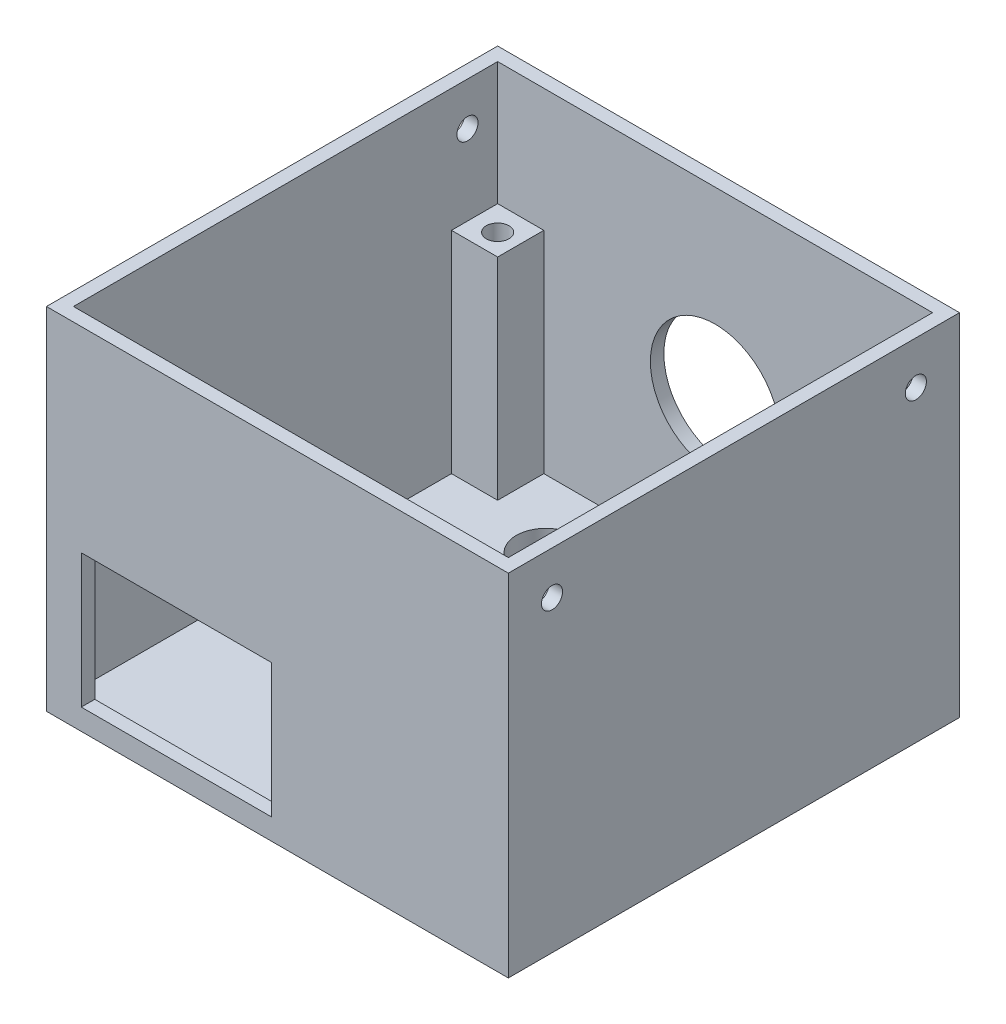
ISO-10303-21;
HEADER;
FILE_DESCRIPTION(('STEP AP214'),'2;1');
FILE_NAME('part.step','',(''),(''),'','','');
FILE_SCHEMA(('AUTOMOTIVE_DESIGN { 1 0 10303 214 1 1 1 1 }'));
ENDSEC;
DATA;
#1=APPLICATION_CONTEXT('core data for automotive mechanical design processes');
#2=APPLICATION_PROTOCOL_DEFINITION('international standard','automotive_design',2000,#1);
#3=PRODUCT_CONTEXT('',#1,'mechanical');
#4=PRODUCT('Part','Part','',(#3));
#5=PRODUCT_RELATED_PRODUCT_CATEGORY('part','',(#4));
#6=PRODUCT_DEFINITION_FORMATION('','',#4);
#7=PRODUCT_DEFINITION_CONTEXT('part definition',#1,'design');
#8=PRODUCT_DEFINITION('design','',#6,#7);
#9=PRODUCT_DEFINITION_SHAPE('','',#8);
#10=(LENGTH_UNIT() NAMED_UNIT(*) SI_UNIT(.MILLI.,.METRE.));
#11=(NAMED_UNIT(*) PLANE_ANGLE_UNIT() SI_UNIT($,.RADIAN.));
#12=(NAMED_UNIT(*) SI_UNIT($,.STERADIAN.) SOLID_ANGLE_UNIT());
#13=UNCERTAINTY_MEASURE_WITH_UNIT(LENGTH_MEASURE(1.E-05),#10,'distance_accuracy_value','');
#14=(GEOMETRIC_REPRESENTATION_CONTEXT(3) GLOBAL_UNCERTAINTY_ASSIGNED_CONTEXT((#13)) GLOBAL_UNIT_ASSIGNED_CONTEXT((#10,
#11,#12)) REPRESENTATION_CONTEXT('',''));
#15=CARTESIAN_POINT('',(0.,0.,0.));
#16=DIRECTION('',(0.,0.,1.));
#17=DIRECTION('',(1.,0.,0.));
#18=AXIS2_PLACEMENT_3D('',#15,#16,#17);
#19=CARTESIAN_POINT('',(0.,1.99999999999999,0.));
#20=DIRECTION('',(0.,1.,0.));
#21=DIRECTION('',(0.,0.,1.));
#22=AXIS2_PLACEMENT_3D('',#19,#20,#21);
#23=PLANE('',#22);
#24=CARTESIAN_POINT('',(12.6537793137482,1.99999999999999,10.0357560074556));
#25=DIRECTION('',(0.,1.,0.));
#26=DIRECTION('',(0.,0.,1.));
#27=AXIS2_PLACEMENT_3D('',#24,#25,#26);
#28=CIRCLE('',#27,3.6);
#29=CARTESIAN_POINT('',(12.6537793137482,1.99999999999999,13.6357560074556));
#30=VERTEX_POINT('',#29);
#31=EDGE_CURVE('E219',#30,#30,#28,.F.);
#32=ORIENTED_EDGE('',*,*,#31,.T.);
#33=EDGE_LOOP('',(#32));
#34=FACE_BOUND('',#33,.T.);
#35=CARTESIAN_POINT('',(8.72674435430912,1.99999999999999,-1.52718026200394));
#36=DIRECTION('',(0.,1.,0.));
#37=DIRECTION('',(0.,0.,1.));
#38=AXIS2_PLACEMENT_3D('',#35,#36,#37);
#39=CIRCLE('',#38,3.1);
#40=CARTESIAN_POINT('',(8.72674435430912,1.99999999999999,1.57281973799606));
#41=VERTEX_POINT('',#40);
#42=EDGE_CURVE('E225',#41,#41,#39,.F.);
#43=ORIENTED_EDGE('',*,*,#42,.T.);
#44=EDGE_LOOP('',(#43));
#45=FACE_BOUND('',#44,.T.);
#46=CARTESIAN_POINT('',(16.9080671864739,1.99999999999999,-1.52718026200394));
#47=DIRECTION('',(0.,1.,0.));
#48=DIRECTION('',(0.,0.,1.));
#49=AXIS2_PLACEMENT_3D('',#46,#47,#48);
#50=CIRCLE('',#49,3.1);
#51=CARTESIAN_POINT('',(16.9080671864739,1.99999999999999,1.57281973799606));
#52=VERTEX_POINT('',#51);
#53=EDGE_CURVE('E231',#52,#52,#50,.F.);
#54=ORIENTED_EDGE('',*,*,#53,.T.);
#55=EDGE_LOOP('',(#54));
#56=FACE_BOUND('',#55,.T.);
#57=CARTESIAN_POINT('',(-12.1083577916039,1.99999999999999,-17.1868597737186));
#58=DIRECTION('',(0.,1.,0.));
#59=DIRECTION('',(0.,0.,1.));
#60=AXIS2_PLACEMENT_3D('',#57,#58,#59);
#61=CIRCLE('',#60,3.5);
#62=CARTESIAN_POINT('',(-12.1083577916039,1.99999999999999,-13.6868597737186));
#63=VERTEX_POINT('',#62);
#64=EDGE_CURVE('E237',#63,#63,#61,.F.);
#65=ORIENTED_EDGE('',*,*,#64,.T.);
#66=EDGE_LOOP('',(#65));
#67=FACE_BOUND('',#66,.T.);
#68=CARTESIAN_POINT('',(12.7628636181771,1.99999999999999,-17.1868597737186));
#69=DIRECTION('',(0.,1.,0.));
#70=DIRECTION('',(0.,0.,1.));
#71=AXIS2_PLACEMENT_3D('',#68,#69,#70);
#72=CIRCLE('',#71,3.5);
#73=CARTESIAN_POINT('',(12.7628636181771,1.99999999999999,-13.6868597737186));
#74=VERTEX_POINT('',#73);
#75=EDGE_CURVE('E243',#74,#74,#72,.F.);
#76=ORIENTED_EDGE('',*,*,#75,.T.);
#77=EDGE_LOOP('',(#76));
#78=FACE_BOUND('',#77,.T.);
#79=DIRECTION('',(0.,0.,1.));
#80=VECTOR('',#79,1.);
#81=CARTESIAN_POINT('',(20.32,1.99999999999999,25.165));
#82=LINE('',#81,#80);
#83=CARTESIAN_POINT('',(20.32,1.99999999999999,19.685));
#84=VERTEX_POINT('',#83);
#85=CARTESIAN_POINT('',(20.32,1.99999999999999,25.165));
#86=VERTEX_POINT('',#85);
#87=EDGE_CURVE('E274',#84,#86,#82,.T.);
#88=ORIENTED_EDGE('',*,*,#87,.F.);
#89=DIRECTION('',(-1.,0.,0.));
#90=VECTOR('',#89,1.);
#91=CARTESIAN_POINT('',(25.8,1.99999999999999,19.685));
#92=LINE('',#91,#90);
#93=CARTESIAN_POINT('',(25.8,1.99999999999999,19.685));
#94=VERTEX_POINT('',#93);
#95=EDGE_CURVE('E267',#94,#84,#92,.T.);
#96=ORIENTED_EDGE('',*,*,#95,.F.);
#97=DIRECTION('',(0.,0.,-1.));
#98=VECTOR('',#97,1.);
#99=CARTESIAN_POINT('',(25.8,1.99999999999999,25.165));
#100=LINE('',#99,#98);
#101=CARTESIAN_POINT('',(25.8,1.99999999999999,-19.685));
#102=VERTEX_POINT('',#101);
#103=EDGE_CURVE('E346',#94,#102,#100,.T.);
#104=ORIENTED_EDGE('',*,*,#103,.T.);
#105=DIRECTION('',(1.,0.,0.));
#106=VECTOR('',#105,1.);
#107=CARTESIAN_POINT('',(25.8,1.99999999999999,-19.685));
#108=LINE('',#107,#106);
#109=CARTESIAN_POINT('',(20.32,1.99999999999999,-19.685));
#110=VERTEX_POINT('',#109);
#111=EDGE_CURVE('E296',#110,#102,#108,.T.);
#112=ORIENTED_EDGE('',*,*,#111,.F.);
#113=DIRECTION('',(0.,0.,1.));
#114=VECTOR('',#113,1.);
#115=CARTESIAN_POINT('',(20.32,1.99999999999999,-25.165));
#116=LINE('',#115,#114);
#117=CARTESIAN_POINT('',(20.32,1.99999999999999,-25.165));
#118=VERTEX_POINT('',#117);
#119=EDGE_CURVE('E291',#118,#110,#116,.T.);
#120=ORIENTED_EDGE('',*,*,#119,.F.);
#121=DIRECTION('',(-1.,0.,0.));
#122=VECTOR('',#121,1.);
#123=CARTESIAN_POINT('',(25.8,1.99999999999999,-25.165));
#124=LINE('',#123,#122);
#125=CARTESIAN_POINT('',(-20.32,1.99999999999999,-25.165));
#126=VERTEX_POINT('',#125);
#127=EDGE_CURVE('E348',#118,#126,#124,.T.);
#128=ORIENTED_EDGE('',*,*,#127,.T.);
#129=DIRECTION('',(0.,0.,-1.));
#130=VECTOR('',#129,1.);
#131=CARTESIAN_POINT('',(-20.32,1.99999999999999,-25.165));
#132=LINE('',#131,#130);
#133=CARTESIAN_POINT('',(-20.32,1.99999999999999,-19.685));
#134=VERTEX_POINT('',#133);
#135=EDGE_CURVE('E322',#134,#126,#132,.T.);
#136=ORIENTED_EDGE('',*,*,#135,.F.);
#137=DIRECTION('',(1.,0.,0.));
#138=VECTOR('',#137,1.);
#139=CARTESIAN_POINT('',(-25.8,1.99999999999999,-19.685));
#140=LINE('',#139,#138);
#141=CARTESIAN_POINT('',(-25.8,1.99999999999999,-19.685));
#142=VERTEX_POINT('',#141);
#143=EDGE_CURVE('E317',#142,#134,#140,.T.);
#144=ORIENTED_EDGE('',*,*,#143,.F.);
#145=DIRECTION('',(0.,0.,1.));
#146=VECTOR('',#145,1.);
#147=CARTESIAN_POINT('',(-25.8,1.99999999999999,25.165));
#148=LINE('',#147,#146);
#149=CARTESIAN_POINT('',(-25.8,1.99999999999999,25.165));
#150=VERTEX_POINT('',#149);
#151=EDGE_CURVE('E340',#142,#150,#148,.T.);
#152=ORIENTED_EDGE('',*,*,#151,.T.);
#153=DIRECTION('',(1.,0.,0.));
#154=VECTOR('',#153,1.);
#155=CARTESIAN_POINT('',(25.8,1.99999999999999,25.165));
#156=LINE('',#155,#154);
#157=EDGE_CURVE('E342',#150,#86,#156,.T.);
#158=ORIENTED_EDGE('',*,*,#157,.T.);
#159=EDGE_LOOP('',(#88,#96,#104,#112,#120,#128,#136,#144,#152,#158));
#160=FACE_BOUND('',#159,.T.);
#161=ADVANCED_FACE('F32',(#34,#45,#56,#67,#78,#160),#23,.T.);
#162=CARTESIAN_POINT('',(25.8,1.99999999999999,25.165));
#163=DIRECTION('',(1.,0.,0.));
#164=DIRECTION('',(0.,0.,-1.));
#165=AXIS2_PLACEMENT_3D('',#162,#163,#164);
#166=PLANE('',#165);
#167=CARTESIAN_POINT('',(25.8,36.49,-21.585));
#168=DIRECTION('',(1.,0.,0.));
#169=DIRECTION('',(0.,0.,-1.));
#170=AXIS2_PLACEMENT_3D('',#167,#168,#169);
#171=CIRCLE('',#170,1.25);
#172=CARTESIAN_POINT('',(25.8,36.49,-22.835));
#173=VERTEX_POINT('',#172);
#174=EDGE_CURVE('E203',#173,#173,#171,.F.);
#175=ORIENTED_EDGE('',*,*,#174,.F.);
#176=EDGE_LOOP('',(#175));
#177=FACE_BOUND('',#176,.T.);
#178=CARTESIAN_POINT('',(25.8,36.49,21.585));
#179=DIRECTION('',(1.,0.,0.));
#180=DIRECTION('',(0.,0.,-1.));
#181=AXIS2_PLACEMENT_3D('',#178,#179,#180);
#182=CIRCLE('',#181,1.25);
#183=CARTESIAN_POINT('',(25.8,36.49,20.335));
#184=VERTEX_POINT('',#183);
#185=EDGE_CURVE('E216',#184,#184,#182,.F.);
#186=ORIENTED_EDGE('',*,*,#185,.F.);
#187=EDGE_LOOP('',(#186));
#188=FACE_BOUND('',#187,.T.);
#189=DIRECTION('',(0.,-1.,0.));
#190=VECTOR('',#189,1.);
#191=CARTESIAN_POINT('',(25.8,27.,19.685));
#192=LINE('',#191,#190);
#193=CARTESIAN_POINT('',(25.8,27.,19.685));
#194=VERTEX_POINT('',#193);
#195=EDGE_CURVE('E289',#194,#94,#192,.T.);
#196=ORIENTED_EDGE('',*,*,#195,.F.);
#197=DIRECTION('',(0.,0.,-1.));
#198=VECTOR('',#197,1.);
#199=CARTESIAN_POINT('',(25.8,27.,25.165));
#200=LINE('',#199,#198);
#201=CARTESIAN_POINT('',(25.8,27.,25.165));
#202=VERTEX_POINT('',#201);
#203=EDGE_CURVE('E270',#202,#194,#200,.T.);
#204=ORIENTED_EDGE('',*,*,#203,.F.);
#205=DIRECTION('',(0.,1.,0.));
#206=VECTOR('',#205,1.);
#207=CARTESIAN_POINT('',(25.8,1.99999999999999,25.165));
#208=LINE('',#207,#206);
#209=CARTESIAN_POINT('',(25.8,41.6,25.165));
#210=VERTEX_POINT('',#209);
#211=EDGE_CURVE('E365',#202,#210,#208,.T.);
#212=ORIENTED_EDGE('',*,*,#211,.T.);
#213=DIRECTION('',(0.,0.,-1.));
#214=VECTOR('',#213,1.);
#215=CARTESIAN_POINT('',(25.8,41.6,25.165));
#216=LINE('',#215,#214);
#217=CARTESIAN_POINT('',(25.8,41.6,-25.165));
#218=VERTEX_POINT('',#217);
#219=EDGE_CURVE('E355',#210,#218,#216,.T.);
#220=ORIENTED_EDGE('',*,*,#219,.T.);
#221=DIRECTION('',(0.,1.,0.));
#222=VECTOR('',#221,1.);
#223=CARTESIAN_POINT('',(25.8,1.99999999999999,-25.165));
#224=LINE('',#223,#222);
#225=CARTESIAN_POINT('',(25.8,27.,-25.165));
#226=VERTEX_POINT('',#225);
#227=EDGE_CURVE('E363',#226,#218,#224,.T.);
#228=ORIENTED_EDGE('',*,*,#227,.F.);
#229=DIRECTION('',(0.,0.,-1.));
#230=VECTOR('',#229,1.);
#231=CARTESIAN_POINT('',(25.8,27.,-25.165));
#232=LINE('',#231,#230);
#233=CARTESIAN_POINT('',(25.8,27.,-19.685));
#234=VERTEX_POINT('',#233);
#235=EDGE_CURVE('E292',#234,#226,#232,.T.);
#236=ORIENTED_EDGE('',*,*,#235,.F.);
#237=DIRECTION('',(0.,-1.,0.));
#238=VECTOR('',#237,1.);
#239=CARTESIAN_POINT('',(25.8,27.,-19.685));
#240=LINE('',#239,#238);
#241=EDGE_CURVE('E304',#234,#102,#240,.T.);
#242=ORIENTED_EDGE('',*,*,#241,.T.);
#243=ORIENTED_EDGE('',*,*,#103,.F.);
#244=EDGE_LOOP('',(#196,#204,#212,#220,#228,#236,#242,#243));
#245=FACE_BOUND('',#244,.T.);
#246=ADVANCED_FACE('F425',(#177,#188,#245),#166,.F.);
#247=CARTESIAN_POINT('',(25.8,1.99999999999999,25.165));
#248=DIRECTION('',(0.,0.,1.));
#249=DIRECTION('',(1.,0.,0.));
#250=AXIS2_PLACEMENT_3D('',#247,#248,#249);
#251=PLANE('',#250);
#252=DIRECTION('',(1.,0.,0.));
#253=VECTOR('',#252,1.);
#254=CARTESIAN_POINT('',(-0.689744760836938,18.3623622473897,25.165));
#255=LINE('',#254,#253);
#256=CARTESIAN_POINT('',(-23.271480249941,18.3623622473897,25.165));
#257=VERTEX_POINT('',#256);
#258=CARTESIAN_POINT('',(-0.689744760836938,18.3623622473897,25.165));
#259=VERTEX_POINT('',#258);
#260=EDGE_CURVE('E179',#257,#259,#255,.T.);
#261=ORIENTED_EDGE('',*,*,#260,.F.);
#262=DIRECTION('',(0.,1.,0.));
#263=VECTOR('',#262,1.);
#264=CARTESIAN_POINT('',(-23.271480249941,2.5,25.165));
#265=LINE('',#264,#263);
#266=CARTESIAN_POINT('',(-23.271480249941,2.5,25.165));
#267=VERTEX_POINT('',#266);
#268=EDGE_CURVE('E186',#267,#257,#265,.T.);
#269=ORIENTED_EDGE('',*,*,#268,.F.);
#270=DIRECTION('',(-1.,0.,0.));
#271=VECTOR('',#270,1.);
#272=CARTESIAN_POINT('',(-0.689744760836938,2.5,25.165));
#273=LINE('',#272,#271);
#274=CARTESIAN_POINT('',(-0.689744760836938,2.5,25.165));
#275=VERTEX_POINT('',#274);
#276=EDGE_CURVE('E191',#275,#267,#273,.T.);
#277=ORIENTED_EDGE('',*,*,#276,.F.);
#278=DIRECTION('',(0.,-1.,0.));
#279=VECTOR('',#278,1.);
#280=CARTESIAN_POINT('',(-0.689744760836938,2.5,25.165));
#281=LINE('',#280,#279);
#282=EDGE_CURVE('E47',#259,#275,#281,.T.);
#283=ORIENTED_EDGE('',*,*,#282,.F.);
#284=EDGE_LOOP('',(#261,#269,#277,#283));
#285=FACE_BOUND('',#284,.T.);
#286=DIRECTION('',(0.,-1.,0.));
#287=VECTOR('',#286,1.);
#288=CARTESIAN_POINT('',(20.32,27.,25.165));
#289=LINE('',#288,#287);
#290=CARTESIAN_POINT('',(20.32,27.,25.165));
#291=VERTEX_POINT('',#290);
#292=EDGE_CURVE('E281',#291,#86,#289,.T.);
#293=ORIENTED_EDGE('',*,*,#292,.T.);
#294=ORIENTED_EDGE('',*,*,#157,.F.);
#295=DIRECTION('',(0.,1.,0.));
#296=VECTOR('',#295,1.);
#297=CARTESIAN_POINT('',(-25.8,1.99999999999999,25.165));
#298=LINE('',#297,#296);
#299=CARTESIAN_POINT('',(-25.8,41.6,25.165));
#300=VERTEX_POINT('',#299);
#301=EDGE_CURVE('E350',#150,#300,#298,.T.);
#302=ORIENTED_EDGE('',*,*,#301,.T.);
#303=DIRECTION('',(1.,0.,0.));
#304=VECTOR('',#303,1.);
#305=CARTESIAN_POINT('',(25.8,41.6,25.165));
#306=LINE('',#305,#304);
#307=EDGE_CURVE('E352',#300,#210,#306,.T.);
#308=ORIENTED_EDGE('',*,*,#307,.T.);
#309=ORIENTED_EDGE('',*,*,#211,.F.);
#310=DIRECTION('',(1.,0.,0.));
#311=VECTOR('',#310,1.);
#312=CARTESIAN_POINT('',(25.8,27.,25.165));
#313=LINE('',#312,#311);
#314=EDGE_CURVE('E279',#291,#202,#313,.T.);
#315=ORIENTED_EDGE('',*,*,#314,.F.);
#316=EDGE_LOOP('',(#293,#294,#302,#308,#309,#315));
#317=FACE_BOUND('',#316,.T.);
#318=ADVANCED_FACE('F193',(#285,#317),#251,.F.);
#319=CARTESIAN_POINT('',(25.8,1.99999999999999,-25.165));
#320=DIRECTION('',(0.,0.,-1.));
#321=DIRECTION('',(-1.,0.,0.));
#322=AXIS2_PLACEMENT_3D('',#319,#320,#321);
#323=PLANE('',#322);
#324=CARTESIAN_POINT('',(0.,19.8507851858219,-25.165));
#325=DIRECTION('',(0.,0.,-1.));
#326=DIRECTION('',(-1.,0.,0.));
#327=AXIS2_PLACEMENT_3D('',#324,#325,#326);
#328=CIRCLE('',#327,7.68049554191523);
#329=CARTESIAN_POINT('',(-7.68049554191524,19.8507851858219,-25.165));
#330=VERTEX_POINT('',#329);
#331=EDGE_CURVE('E204',#330,#330,#328,.F.);
#332=ORIENTED_EDGE('',*,*,#331,.F.);
#333=EDGE_LOOP('',(#332));
#334=FACE_BOUND('',#333,.T.);
#335=DIRECTION('',(0.,-1.,0.));
#336=VECTOR('',#335,1.);
#337=CARTESIAN_POINT('',(20.32,27.,-25.165));
#338=LINE('',#337,#336);
#339=CARTESIAN_POINT('',(20.32,27.,-25.165));
#340=VERTEX_POINT('',#339);
#341=EDGE_CURVE('E314',#340,#118,#338,.T.);
#342=ORIENTED_EDGE('',*,*,#341,.F.);
#343=DIRECTION('',(-1.,0.,0.));
#344=VECTOR('',#343,1.);
#345=CARTESIAN_POINT('',(25.8,27.,-25.165));
#346=LINE('',#345,#344);
#347=EDGE_CURVE('E295',#226,#340,#346,.T.);
#348=ORIENTED_EDGE('',*,*,#347,.F.);
#349=ORIENTED_EDGE('',*,*,#227,.T.);
#350=DIRECTION('',(-1.,0.,0.));
#351=VECTOR('',#350,1.);
#352=CARTESIAN_POINT('',(25.8,41.6,-25.165));
#353=LINE('',#352,#351);
#354=CARTESIAN_POINT('',(-25.8,41.6,-25.165));
#355=VERTEX_POINT('',#354);
#356=EDGE_CURVE('E343',#218,#355,#353,.T.);
#357=ORIENTED_EDGE('',*,*,#356,.T.);
#358=DIRECTION('',(0.,1.,0.));
#359=VECTOR('',#358,1.);
#360=CARTESIAN_POINT('',(-25.8,1.99999999999999,-25.165));
#361=LINE('',#360,#359);
#362=CARTESIAN_POINT('',(-25.8,27.,-25.165));
#363=VERTEX_POINT('',#362);
#364=EDGE_CURVE('E360',#363,#355,#361,.T.);
#365=ORIENTED_EDGE('',*,*,#364,.F.);
#366=DIRECTION('',(-1.,0.,0.));
#367=VECTOR('',#366,1.);
#368=CARTESIAN_POINT('',(-25.8,27.,-25.165));
#369=LINE('',#368,#367);
#370=CARTESIAN_POINT('',(-20.32,27.,-25.165));
#371=VERTEX_POINT('',#370);
#372=EDGE_CURVE('E326',#371,#363,#369,.T.);
#373=ORIENTED_EDGE('',*,*,#372,.F.);
#374=DIRECTION('',(0.,-1.,0.));
#375=VECTOR('',#374,1.);
#376=CARTESIAN_POINT('',(-20.32,27.,-25.165));
#377=LINE('',#376,#375);
#378=EDGE_CURVE('E328',#371,#126,#377,.T.);
#379=ORIENTED_EDGE('',*,*,#378,.T.);
#380=ORIENTED_EDGE('',*,*,#127,.F.);
#381=EDGE_LOOP('',(#342,#348,#349,#357,#365,#373,#379,#380));
#382=FACE_BOUND('',#381,.T.);
#383=ADVANCED_FACE('F438',(#334,#382),#323,.F.);
#384=CARTESIAN_POINT('',(-25.8,1.99999999999999,25.165));
#385=DIRECTION('',(-1.,0.,0.));
#386=DIRECTION('',(0.,0.,1.));
#387=AXIS2_PLACEMENT_3D('',#384,#385,#386);
#388=PLANE('',#387);
#389=CARTESIAN_POINT('',(-25.8,36.49,-21.585));
#390=DIRECTION('',(-1.,0.,0.));
#391=DIRECTION('',(0.,0.,1.));
#392=AXIS2_PLACEMENT_3D('',#389,#390,#391);
#393=CIRCLE('',#392,1.25);
#394=CARTESIAN_POINT('',(-25.8,36.49,-20.335));
#395=VERTEX_POINT('',#394);
#396=EDGE_CURVE('E210',#395,#395,#393,.F.);
#397=ORIENTED_EDGE('',*,*,#396,.F.);
#398=EDGE_LOOP('',(#397));
#399=FACE_BOUND('',#398,.T.);
#400=DIRECTION('',(0.,-1.,0.));
#401=VECTOR('',#400,1.);
#402=CARTESIAN_POINT('',(-25.8,27.,-19.685));
#403=LINE('',#402,#401);
#404=CARTESIAN_POINT('',(-25.8,27.,-19.685));
#405=VERTEX_POINT('',#404);
#406=EDGE_CURVE('E337',#405,#142,#403,.T.);
#407=ORIENTED_EDGE('',*,*,#406,.F.);
#408=DIRECTION('',(0.,0.,1.));
#409=VECTOR('',#408,1.);
#410=CARTESIAN_POINT('',(-25.8,27.,-25.165));
#411=LINE('',#410,#409);
#412=EDGE_CURVE('E318',#363,#405,#411,.T.);
#413=ORIENTED_EDGE('',*,*,#412,.F.);
#414=ORIENTED_EDGE('',*,*,#364,.T.);
#415=DIRECTION('',(0.,0.,1.));
#416=VECTOR('',#415,1.);
#417=CARTESIAN_POINT('',(-25.8,41.6,25.165));
#418=LINE('',#417,#416);
#419=EDGE_CURVE('E339',#355,#300,#418,.T.);
#420=ORIENTED_EDGE('',*,*,#419,.T.);
#421=ORIENTED_EDGE('',*,*,#301,.F.);
#422=ORIENTED_EDGE('',*,*,#151,.F.);
#423=EDGE_LOOP('',(#407,#413,#414,#420,#421,#422));
#424=FACE_BOUND('',#423,.T.);
#425=ADVANCED_FACE('F421',(#399,#424),#388,.F.);
#426=CARTESIAN_POINT('',(-27.4,41.6,26.765));
#427=DIRECTION('',(1.,0.,0.));
#428=DIRECTION('',(0.,0.,-1.));
#429=AXIS2_PLACEMENT_3D('',#426,#427,#428);
#430=PLANE('',#429);
#431=CARTESIAN_POINT('',(-27.4,36.49,-21.585));
#432=DIRECTION('',(-1.,0.,0.));
#433=DIRECTION('',(0.,0.,1.));
#434=AXIS2_PLACEMENT_3D('',#431,#432,#433);
#435=CIRCLE('',#434,1.25);
#436=CARTESIAN_POINT('',(-27.4,36.49,-20.335));
#437=VERTEX_POINT('',#436);
#438=EDGE_CURVE('E207',#437,#437,#435,.T.);
#439=ORIENTED_EDGE('',*,*,#438,.F.);
#440=EDGE_LOOP('',(#439));
#441=FACE_BOUND('',#440,.T.);
#442=DIRECTION('',(0.,0.,1.));
#443=VECTOR('',#442,1.);
#444=CARTESIAN_POINT('',(-27.4,0.,26.765));
#445=LINE('',#444,#443);
#446=CARTESIAN_POINT('',(-27.4,0.,-26.765));
#447=VERTEX_POINT('',#446);
#448=CARTESIAN_POINT('',(-27.4,0.,26.765));
#449=VERTEX_POINT('',#448);
#450=EDGE_CURVE('E362',#447,#449,#445,.T.);
#451=ORIENTED_EDGE('',*,*,#450,.T.);
#452=DIRECTION('',(0.,-1.,0.));
#453=VECTOR('',#452,1.);
#454=CARTESIAN_POINT('',(-27.4,41.6,26.765));
#455=LINE('',#454,#453);
#456=CARTESIAN_POINT('',(-27.4,41.6,26.765));
#457=VERTEX_POINT('',#456);
#458=EDGE_CURVE('E11',#457,#449,#455,.T.);
#459=ORIENTED_EDGE('',*,*,#458,.F.);
#460=DIRECTION('',(0.,0.,1.));
#461=VECTOR('',#460,1.);
#462=CARTESIAN_POINT('',(-27.4,41.6,26.765));
#463=LINE('',#462,#461);
#464=CARTESIAN_POINT('',(-27.4,41.6,-26.765));
#465=VERTEX_POINT('',#464);
#466=EDGE_CURVE('E369',#465,#457,#463,.T.);
#467=ORIENTED_EDGE('',*,*,#466,.F.);
#468=DIRECTION('',(0.,-1.,0.));
#469=VECTOR('',#468,1.);
#470=CARTESIAN_POINT('',(-27.4,41.6,-26.765));
#471=LINE('',#470,#469);
#472=EDGE_CURVE('E379',#465,#447,#471,.T.);
#473=ORIENTED_EDGE('',*,*,#472,.T.);
#474=EDGE_LOOP('',(#451,#459,#467,#473));
#475=FACE_BOUND('',#474,.T.);
#476=ADVANCED_FACE('F34',(#441,#475),#430,.F.);
#477=CARTESIAN_POINT('',(27.4,41.6,26.765));
#478=DIRECTION('',(0.,0.,-1.));
#479=DIRECTION('',(-1.,0.,0.));
#480=AXIS2_PLACEMENT_3D('',#477,#478,#479);
#481=PLANE('',#480);
#482=DIRECTION('',(1.,0.,0.));
#483=VECTOR('',#482,1.);
#484=CARTESIAN_POINT('',(-0.689744760836938,2.5,26.765));
#485=LINE('',#484,#483);
#486=CARTESIAN_POINT('',(-23.271480249941,2.5,26.765));
#487=VERTEX_POINT('',#486);
#488=CARTESIAN_POINT('',(-0.689744760836938,2.5,26.765));
#489=VERTEX_POINT('',#488);
#490=EDGE_CURVE('E839',#487,#489,#485,.T.);
#491=ORIENTED_EDGE('',*,*,#490,.F.);
#492=DIRECTION('',(0.,-1.,0.));
#493=VECTOR('',#492,1.);
#494=CARTESIAN_POINT('',(-23.271480249941,2.5,26.765));
#495=LINE('',#494,#493);
#496=CARTESIAN_POINT('',(-23.271480249941,18.3623622473897,26.765));
#497=VERTEX_POINT('',#496);
#498=EDGE_CURVE('E55',#497,#487,#495,.T.);
#499=ORIENTED_EDGE('',*,*,#498,.F.);
#500=DIRECTION('',(-1.,0.,0.));
#501=VECTOR('',#500,1.);
#502=CARTESIAN_POINT('',(-0.689744760836938,18.3623622473897,26.765));
#503=LINE('',#502,#501);
#504=CARTESIAN_POINT('',(-0.689744760836938,18.3623622473897,26.765));
#505=VERTEX_POINT('',#504);
#506=EDGE_CURVE('E181',#505,#497,#503,.T.);
#507=ORIENTED_EDGE('',*,*,#506,.F.);
#508=DIRECTION('',(0.,1.,0.));
#509=VECTOR('',#508,1.);
#510=CARTESIAN_POINT('',(-0.689744760836938,2.5,26.765));
#511=LINE('',#510,#509);
#512=EDGE_CURVE('E836',#489,#505,#511,.T.);
#513=ORIENTED_EDGE('',*,*,#512,.F.);
#514=EDGE_LOOP('',(#491,#499,#507,#513));
#515=FACE_BOUND('',#514,.T.);
#516=DIRECTION('',(1.,0.,0.));
#517=VECTOR('',#516,1.);
#518=CARTESIAN_POINT('',(27.4,0.,26.765));
#519=LINE('',#518,#517);
#520=CARTESIAN_POINT('',(27.4,0.,26.765));
#521=VERTEX_POINT('',#520);
#522=EDGE_CURVE('E382',#449,#521,#519,.T.);
#523=ORIENTED_EDGE('',*,*,#522,.T.);
#524=DIRECTION('',(0.,-1.,0.));
#525=VECTOR('',#524,1.);
#526=CARTESIAN_POINT('',(27.4,41.6,26.765));
#527=LINE('',#526,#525);
#528=CARTESIAN_POINT('',(27.4,41.6,26.765));
#529=VERTEX_POINT('',#528);
#530=EDGE_CURVE('E40',#529,#521,#527,.T.);
#531=ORIENTED_EDGE('',*,*,#530,.F.);
#532=DIRECTION('',(1.,0.,0.));
#533=VECTOR('',#532,1.);
#534=CARTESIAN_POINT('',(27.4,41.6,26.765));
#535=LINE('',#534,#533);
#536=EDGE_CURVE('E372',#457,#529,#535,.T.);
#537=ORIENTED_EDGE('',*,*,#536,.F.);
#538=ORIENTED_EDGE('',*,*,#458,.T.);
#539=EDGE_LOOP('',(#523,#531,#537,#538));
#540=FACE_BOUND('',#539,.T.);
#541=ADVANCED_FACE('F412',(#515,#540),#481,.F.);
#542=CARTESIAN_POINT('',(27.4,41.6,26.765));
#543=DIRECTION('',(-1.,0.,0.));
#544=DIRECTION('',(0.,0.,1.));
#545=AXIS2_PLACEMENT_3D('',#542,#543,#544);
#546=PLANE('',#545);
#547=CARTESIAN_POINT('',(27.4,36.49,-21.585));
#548=DIRECTION('',(1.,0.,0.));
#549=DIRECTION('',(0.,0.,-1.));
#550=AXIS2_PLACEMENT_3D('',#547,#548,#549);
#551=CIRCLE('',#550,1.25);
#552=CARTESIAN_POINT('',(27.4,36.49,-22.835));
#553=VERTEX_POINT('',#552);
#554=EDGE_CURVE('E827',#553,#553,#551,.T.);
#555=ORIENTED_EDGE('',*,*,#554,.F.);
#556=EDGE_LOOP('',(#555));
#557=FACE_BOUND('',#556,.T.);
#558=CARTESIAN_POINT('',(27.4,36.49,21.585));
#559=DIRECTION('',(1.,0.,0.));
#560=DIRECTION('',(0.,0.,-1.));
#561=AXIS2_PLACEMENT_3D('',#558,#559,#560);
#562=CIRCLE('',#561,1.25);
#563=CARTESIAN_POINT('',(27.4,36.49,20.335));
#564=VERTEX_POINT('',#563);
#565=EDGE_CURVE('E213',#564,#564,#562,.T.);
#566=ORIENTED_EDGE('',*,*,#565,.F.);
#567=EDGE_LOOP('',(#566));
#568=FACE_BOUND('',#567,.T.);
#569=DIRECTION('',(0.,0.,-1.));
#570=VECTOR('',#569,1.);
#571=CARTESIAN_POINT('',(27.4,0.,26.765));
#572=LINE('',#571,#570);
#573=CARTESIAN_POINT('',(27.4,0.,-26.765));
#574=VERTEX_POINT('',#573);
#575=EDGE_CURVE('E384',#521,#574,#572,.T.);
#576=ORIENTED_EDGE('',*,*,#575,.T.);
#577=DIRECTION('',(0.,-1.,0.));
#578=VECTOR('',#577,1.);
#579=CARTESIAN_POINT('',(27.4,41.6,-26.765));
#580=LINE('',#579,#578);
#581=CARTESIAN_POINT('',(27.4,41.6,-26.765));
#582=VERTEX_POINT('',#581);
#583=EDGE_CURVE('E389',#582,#574,#580,.T.);
#584=ORIENTED_EDGE('',*,*,#583,.F.);
#585=DIRECTION('',(0.,0.,-1.));
#586=VECTOR('',#585,1.);
#587=CARTESIAN_POINT('',(27.4,41.6,26.765));
#588=LINE('',#587,#586);
#589=EDGE_CURVE('E375',#529,#582,#588,.T.);
#590=ORIENTED_EDGE('',*,*,#589,.F.);
#591=ORIENTED_EDGE('',*,*,#530,.T.);
#592=EDGE_LOOP('',(#576,#584,#590,#591));
#593=FACE_BOUND('',#592,.T.);
#594=ADVANCED_FACE('F396',(#557,#568,#593),#546,.F.);
#595=CARTESIAN_POINT('',(27.4,41.6,-26.765));
#596=DIRECTION('',(0.,0.,1.));
#597=DIRECTION('',(1.,0.,0.));
#598=AXIS2_PLACEMENT_3D('',#595,#596,#597);
#599=PLANE('',#598);
#600=CARTESIAN_POINT('',(0.,19.8507851858219,-26.765));
#601=DIRECTION('',(0.,0.,-1.));
#602=DIRECTION('',(-1.,0.,0.));
#603=AXIS2_PLACEMENT_3D('',#600,#601,#602);
#604=CIRCLE('',#603,7.68049554191523);
#605=CARTESIAN_POINT('',(-7.68049554191524,19.8507851858219,-26.765));
#606=VERTEX_POINT('',#605);
#607=EDGE_CURVE('E196',#606,#606,#604,.T.);
#608=ORIENTED_EDGE('',*,*,#607,.F.);
#609=EDGE_LOOP('',(#608));
#610=FACE_BOUND('',#609,.T.);
#611=DIRECTION('',(-1.,0.,0.));
#612=VECTOR('',#611,1.);
#613=CARTESIAN_POINT('',(27.4,0.,-26.765));
#614=LINE('',#613,#612);
#615=EDGE_CURVE('E373',#574,#447,#614,.T.);
#616=ORIENTED_EDGE('',*,*,#615,.T.);
#617=ORIENTED_EDGE('',*,*,#472,.F.);
#618=DIRECTION('',(-1.,0.,0.));
#619=VECTOR('',#618,1.);
#620=CARTESIAN_POINT('',(27.4,41.6,-26.765));
#621=LINE('',#620,#619);
#622=EDGE_CURVE('E377',#582,#465,#621,.T.);
#623=ORIENTED_EDGE('',*,*,#622,.F.);
#624=ORIENTED_EDGE('',*,*,#583,.T.);
#625=EDGE_LOOP('',(#616,#617,#623,#624));
#626=FACE_BOUND('',#625,.T.);
#627=ADVANCED_FACE('F405',(#610,#626),#599,.F.);
#628=CARTESIAN_POINT('',(0.,41.6,0.));
#629=DIRECTION('',(0.,1.,0.));
#630=DIRECTION('',(0.,0.,1.));
#631=AXIS2_PLACEMENT_3D('',#628,#629,#630);
#632=PLANE('',#631);
#633=ORIENTED_EDGE('',*,*,#419,.F.);
#634=ORIENTED_EDGE('',*,*,#356,.F.);
#635=ORIENTED_EDGE('',*,*,#219,.F.);
#636=ORIENTED_EDGE('',*,*,#307,.F.);
#637=EDGE_LOOP('',(#633,#634,#635,#636));
#638=FACE_BOUND('',#637,.T.);
#639=ORIENTED_EDGE('',*,*,#466,.T.);
#640=ORIENTED_EDGE('',*,*,#536,.T.);
#641=ORIENTED_EDGE('',*,*,#589,.T.);
#642=ORIENTED_EDGE('',*,*,#622,.T.);
#643=EDGE_LOOP('',(#639,#640,#641,#642));
#644=FACE_BOUND('',#643,.T.);
#645=ADVANCED_FACE('F411',(#638,#644),#632,.T.);
#646=CARTESIAN_POINT('',(0.,0.,0.));
#647=DIRECTION('',(0.,1.,0.));
#648=DIRECTION('',(0.,0.,1.));
#649=AXIS2_PLACEMENT_3D('',#646,#647,#648);
#650=PLANE('',#649);
#651=CARTESIAN_POINT('',(12.6537793137482,0.,10.0357560074556));
#652=DIRECTION('',(0.,-1.,0.));
#653=DIRECTION('',(0.,0.,-1.));
#654=AXIS2_PLACEMENT_3D('',#651,#652,#653);
#655=CIRCLE('',#654,3.6);
#656=CARTESIAN_POINT('',(12.6537793137482,0.,6.43575600745564));
#657=VERTEX_POINT('',#656);
#658=EDGE_CURVE('E222',#657,#657,#655,.T.);
#659=ORIENTED_EDGE('',*,*,#658,.F.);
#660=EDGE_LOOP('',(#659));
#661=FACE_BOUND('',#660,.T.);
#662=CARTESIAN_POINT('',(8.72674435430912,0.,-1.52718026200394));
#663=DIRECTION('',(0.,-1.,0.));
#664=DIRECTION('',(0.,0.,-1.));
#665=AXIS2_PLACEMENT_3D('',#662,#663,#664);
#666=CIRCLE('',#665,3.1);
#667=CARTESIAN_POINT('',(8.72674435430912,0.,-4.62718026200394));
#668=VERTEX_POINT('',#667);
#669=EDGE_CURVE('E228',#668,#668,#666,.T.);
#670=ORIENTED_EDGE('',*,*,#669,.F.);
#671=EDGE_LOOP('',(#670));
#672=FACE_BOUND('',#671,.T.);
#673=CARTESIAN_POINT('',(16.9080671864739,0.,-1.52718026200394));
#674=DIRECTION('',(0.,-1.,0.));
#675=DIRECTION('',(0.,0.,-1.));
#676=AXIS2_PLACEMENT_3D('',#673,#674,#675);
#677=CIRCLE('',#676,3.1);
#678=CARTESIAN_POINT('',(16.9080671864739,0.,-4.62718026200394));
#679=VERTEX_POINT('',#678);
#680=EDGE_CURVE('E234',#679,#679,#677,.T.);
#681=ORIENTED_EDGE('',*,*,#680,.F.);
#682=EDGE_LOOP('',(#681));
#683=FACE_BOUND('',#682,.T.);
#684=CARTESIAN_POINT('',(-12.1083577916039,0.,-17.1868597737186));
#685=DIRECTION('',(0.,-1.,0.));
#686=DIRECTION('',(0.,0.,-1.));
#687=AXIS2_PLACEMENT_3D('',#684,#685,#686);
#688=CIRCLE('',#687,3.5);
#689=CARTESIAN_POINT('',(-12.1083577916039,0.,-20.6868597737186));
#690=VERTEX_POINT('',#689);
#691=EDGE_CURVE('E240',#690,#690,#688,.T.);
#692=ORIENTED_EDGE('',*,*,#691,.F.);
#693=EDGE_LOOP('',(#692));
#694=FACE_BOUND('',#693,.T.);
#695=CARTESIAN_POINT('',(12.7628636181771,0.,-17.1868597737186));
#696=DIRECTION('',(0.,-1.,0.));
#697=DIRECTION('',(0.,0.,-1.));
#698=AXIS2_PLACEMENT_3D('',#695,#696,#697);
#699=CIRCLE('',#698,3.5);
#700=CARTESIAN_POINT('',(12.7628636181771,0.,-20.6868597737186));
#701=VERTEX_POINT('',#700);
#702=EDGE_CURVE('E246',#701,#701,#699,.T.);
#703=ORIENTED_EDGE('',*,*,#702,.F.);
#704=EDGE_LOOP('',(#703));
#705=FACE_BOUND('',#704,.T.);
#706=ORIENTED_EDGE('',*,*,#450,.F.);
#707=ORIENTED_EDGE('',*,*,#615,.F.);
#708=ORIENTED_EDGE('',*,*,#575,.F.);
#709=ORIENTED_EDGE('',*,*,#522,.F.);
#710=EDGE_LOOP('',(#706,#707,#708,#709));
#711=FACE_BOUND('',#710,.T.);
#712=ADVANCED_FACE('F402',(#661,#672,#683,#694,#705,#711),#650,.F.);
#713=CARTESIAN_POINT('',(-25.8,27.,-19.685));
#714=DIRECTION('',(0.,0.,-1.));
#715=DIRECTION('',(-1.,0.,0.));
#716=AXIS2_PLACEMENT_3D('',#713,#714,#715);
#717=PLANE('',#716);
#718=ORIENTED_EDGE('',*,*,#143,.T.);
#719=DIRECTION('',(0.,-1.,0.));
#720=VECTOR('',#719,1.);
#721=CARTESIAN_POINT('',(-20.32,27.,-19.685));
#722=LINE('',#721,#720);
#723=CARTESIAN_POINT('',(-20.32,27.,-19.685));
#724=VERTEX_POINT('',#723);
#725=EDGE_CURVE('E335',#724,#134,#722,.T.);
#726=ORIENTED_EDGE('',*,*,#725,.F.);
#727=DIRECTION('',(1.,0.,0.));
#728=VECTOR('',#727,1.);
#729=CARTESIAN_POINT('',(-25.8,27.,-19.685));
#730=LINE('',#729,#728);
#731=EDGE_CURVE('E321',#405,#724,#730,.T.);
#732=ORIENTED_EDGE('',*,*,#731,.F.);
#733=ORIENTED_EDGE('',*,*,#406,.T.);
#734=EDGE_LOOP('',(#718,#726,#732,#733));
#735=FACE_BOUND('',#734,.T.);
#736=ADVANCED_FACE('F436',(#735),#717,.F.);
#737=CARTESIAN_POINT('',(-20.32,27.,-25.165));
#738=DIRECTION('',(-1.,0.,0.));
#739=DIRECTION('',(0.,0.,1.));
#740=AXIS2_PLACEMENT_3D('',#737,#738,#739);
#741=PLANE('',#740);
#742=ORIENTED_EDGE('',*,*,#135,.T.);
#743=ORIENTED_EDGE('',*,*,#378,.F.);
#744=DIRECTION('',(0.,0.,-1.));
#745=VECTOR('',#744,1.);
#746=CARTESIAN_POINT('',(-20.32,27.,-25.165));
#747=LINE('',#746,#745);
#748=EDGE_CURVE('E324',#724,#371,#747,.T.);
#749=ORIENTED_EDGE('',*,*,#748,.F.);
#750=ORIENTED_EDGE('',*,*,#725,.T.);
#751=EDGE_LOOP('',(#742,#743,#749,#750));
#752=FACE_BOUND('',#751,.T.);
#753=ADVANCED_FACE('F507',(#752),#741,.F.);
#754=CARTESIAN_POINT('',(0.,27.,0.));
#755=DIRECTION('',(0.,1.,0.));
#756=DIRECTION('',(0.,0.,1.));
#757=AXIS2_PLACEMENT_3D('',#754,#755,#756);
#758=PLANE('',#757);
#759=CARTESIAN_POINT('',(-22.86,27.,-22.225));
#760=DIRECTION('',(0.,1.,0.));
#761=DIRECTION('',(0.,0.,1.));
#762=AXIS2_PLACEMENT_3D('',#759,#760,#761);
#763=CIRCLE('',#762,1.35000000000001);
#764=CARTESIAN_POINT('',(-22.86,27.,-20.875));
#765=VERTEX_POINT('',#764);
#766=EDGE_CURVE('E261',#765,#765,#763,.T.);
#767=ORIENTED_EDGE('',*,*,#766,.F.);
#768=EDGE_LOOP('',(#767));
#769=FACE_BOUND('',#768,.T.);
#770=ORIENTED_EDGE('',*,*,#412,.T.);
#771=ORIENTED_EDGE('',*,*,#731,.T.);
#772=ORIENTED_EDGE('',*,*,#748,.T.);
#773=ORIENTED_EDGE('',*,*,#372,.T.);
#774=EDGE_LOOP('',(#770,#771,#772,#773));
#775=FACE_BOUND('',#774,.T.);
#776=ADVANCED_FACE('F504',(#769,#775),#758,.T.);
#777=CARTESIAN_POINT('',(20.32,27.,-25.165));
#778=DIRECTION('',(1.,0.,0.));
#779=DIRECTION('',(0.,0.,-1.));
#780=AXIS2_PLACEMENT_3D('',#777,#778,#779);
#781=PLANE('',#780);
#782=ORIENTED_EDGE('',*,*,#119,.T.);
#783=DIRECTION('',(0.,-1.,0.));
#784=VECTOR('',#783,1.);
#785=CARTESIAN_POINT('',(20.32,27.,-19.685));
#786=LINE('',#785,#784);
#787=CARTESIAN_POINT('',(20.32,27.,-19.685));
#788=VERTEX_POINT('',#787);
#789=EDGE_CURVE('E311',#788,#110,#786,.T.);
#790=ORIENTED_EDGE('',*,*,#789,.F.);
#791=DIRECTION('',(0.,0.,1.));
#792=VECTOR('',#791,1.);
#793=CARTESIAN_POINT('',(20.32,27.,-25.165));
#794=LINE('',#793,#792);
#795=EDGE_CURVE('E299',#340,#788,#794,.T.);
#796=ORIENTED_EDGE('',*,*,#795,.F.);
#797=ORIENTED_EDGE('',*,*,#341,.T.);
#798=EDGE_LOOP('',(#782,#790,#796,#797));
#799=FACE_BOUND('',#798,.T.);
#800=ADVANCED_FACE('F473',(#799),#781,.F.);
#801=CARTESIAN_POINT('',(25.8,27.,-19.685));
#802=DIRECTION('',(0.,0.,-1.));
#803=DIRECTION('',(-1.,0.,0.));
#804=AXIS2_PLACEMENT_3D('',#801,#802,#803);
#805=PLANE('',#804);
#806=ORIENTED_EDGE('',*,*,#111,.T.);
#807=ORIENTED_EDGE('',*,*,#241,.F.);
#808=DIRECTION('',(1.,0.,0.));
#809=VECTOR('',#808,1.);
#810=CARTESIAN_POINT('',(25.8,27.,-19.685));
#811=LINE('',#810,#809);
#812=EDGE_CURVE('E301',#788,#234,#811,.T.);
#813=ORIENTED_EDGE('',*,*,#812,.F.);
#814=ORIENTED_EDGE('',*,*,#789,.T.);
#815=EDGE_LOOP('',(#806,#807,#813,#814));
#816=FACE_BOUND('',#815,.T.);
#817=ADVANCED_FACE('F477',(#816),#805,.F.);
#818=CARTESIAN_POINT('',(0.,27.,0.));
#819=DIRECTION('',(0.,-1.,0.));
#820=DIRECTION('',(0.,0.,-1.));
#821=AXIS2_PLACEMENT_3D('',#818,#819,#820);
#822=PLANE('',#821);
#823=CARTESIAN_POINT('',(22.86,27.,-22.225));
#824=DIRECTION('',(0.,1.,0.));
#825=DIRECTION('',(0.,0.,1.));
#826=AXIS2_PLACEMENT_3D('',#823,#824,#825);
#827=CIRCLE('',#826,1.35);
#828=CARTESIAN_POINT('',(22.86,27.,-20.875));
#829=VERTEX_POINT('',#828);
#830=EDGE_CURVE('E255',#829,#829,#827,.T.);
#831=ORIENTED_EDGE('',*,*,#830,.F.);
#832=EDGE_LOOP('',(#831));
#833=FACE_BOUND('',#832,.T.);
#834=ORIENTED_EDGE('',*,*,#235,.T.);
#835=ORIENTED_EDGE('',*,*,#347,.T.);
#836=ORIENTED_EDGE('',*,*,#795,.T.);
#837=ORIENTED_EDGE('',*,*,#812,.T.);
#838=EDGE_LOOP('',(#834,#835,#836,#837));
#839=FACE_BOUND('',#838,.T.);
#840=ADVANCED_FACE('F471',(#833,#839),#822,.F.);
#841=CARTESIAN_POINT('',(25.8,27.,19.685));
#842=DIRECTION('',(0.,0.,1.));
#843=DIRECTION('',(1.,0.,0.));
#844=AXIS2_PLACEMENT_3D('',#841,#842,#843);
#845=PLANE('',#844);
#846=ORIENTED_EDGE('',*,*,#95,.T.);
#847=DIRECTION('',(0.,-1.,0.));
#848=VECTOR('',#847,1.);
#849=CARTESIAN_POINT('',(20.32,27.,19.685));
#850=LINE('',#849,#848);
#851=CARTESIAN_POINT('',(20.32,27.,19.685));
#852=VERTEX_POINT('',#851);
#853=EDGE_CURVE('E286',#852,#84,#850,.T.);
#854=ORIENTED_EDGE('',*,*,#853,.F.);
#855=DIRECTION('',(-1.,0.,0.));
#856=VECTOR('',#855,1.);
#857=CARTESIAN_POINT('',(25.8,27.,19.685));
#858=LINE('',#857,#856);
#859=EDGE_CURVE('E273',#194,#852,#858,.T.);
#860=ORIENTED_EDGE('',*,*,#859,.F.);
#861=ORIENTED_EDGE('',*,*,#195,.T.);
#862=EDGE_LOOP('',(#846,#854,#860,#861));
#863=FACE_BOUND('',#862,.T.);
#864=ADVANCED_FACE('F510',(#863),#845,.F.);
#865=CARTESIAN_POINT('',(20.32,27.,25.165));
#866=DIRECTION('',(1.,0.,0.));
#867=DIRECTION('',(0.,0.,-1.));
#868=AXIS2_PLACEMENT_3D('',#865,#866,#867);
#869=PLANE('',#868);
#870=ORIENTED_EDGE('',*,*,#87,.T.);
#871=ORIENTED_EDGE('',*,*,#292,.F.);
#872=DIRECTION('',(0.,0.,1.));
#873=VECTOR('',#872,1.);
#874=CARTESIAN_POINT('',(20.32,27.,25.165));
#875=LINE('',#874,#873);
#876=EDGE_CURVE('E276',#852,#291,#875,.T.);
#877=ORIENTED_EDGE('',*,*,#876,.F.);
#878=ORIENTED_EDGE('',*,*,#853,.T.);
#879=EDGE_LOOP('',(#870,#871,#877,#878));
#880=FACE_BOUND('',#879,.T.);
#881=ADVANCED_FACE('F513',(#880),#869,.F.);
#882=CARTESIAN_POINT('',(0.,27.,0.));
#883=DIRECTION('',(0.,1.,0.));
#884=DIRECTION('',(0.,0.,1.));
#885=AXIS2_PLACEMENT_3D('',#882,#883,#884);
#886=PLANE('',#885);
#887=CARTESIAN_POINT('',(22.86,27.,22.2171137415211));
#888=DIRECTION('',(0.,1.,0.));
#889=DIRECTION('',(0.,0.,1.));
#890=AXIS2_PLACEMENT_3D('',#887,#888,#889);
#891=CIRCLE('',#890,1.35);
#892=CARTESIAN_POINT('',(22.86,27.,23.5671137415211));
#893=VERTEX_POINT('',#892);
#894=EDGE_CURVE('E249',#893,#893,#891,.T.);
#895=ORIENTED_EDGE('',*,*,#894,.F.);
#896=EDGE_LOOP('',(#895));
#897=FACE_BOUND('',#896,.T.);
#898=ORIENTED_EDGE('',*,*,#203,.T.);
#899=ORIENTED_EDGE('',*,*,#859,.T.);
#900=ORIENTED_EDGE('',*,*,#876,.T.);
#901=ORIENTED_EDGE('',*,*,#314,.T.);
#902=EDGE_LOOP('',(#898,#899,#900,#901));
#903=FACE_BOUND('',#902,.T.);
#904=ADVANCED_FACE('F515',(#897,#903),#886,.T.);
#905=CARTESIAN_POINT('',(-22.86,17.,-22.225));
#906=DIRECTION('',(0.,1.,0.));
#907=DIRECTION('',(0.,0.,1.));
#908=AXIS2_PLACEMENT_3D('',#905,#906,#907);
#909=CYLINDRICAL_SURFACE('',#908,1.35000000000001);
#910=CARTESIAN_POINT('',(-22.86,17.,-22.225));
#911=DIRECTION('',(0.,1.,0.));
#912=DIRECTION('',(0.,0.,1.));
#913=AXIS2_PLACEMENT_3D('',#910,#911,#912);
#914=CIRCLE('',#913,1.35000000000001);
#915=CARTESIAN_POINT('',(-22.86,17.,-20.875));
#916=VERTEX_POINT('',#915);
#917=EDGE_CURVE('E264',#916,#916,#914,.T.);
#918=ORIENTED_EDGE('',*,*,#917,.F.);
#919=EDGE_LOOP('',(#918));
#920=FACE_BOUND('',#919,.T.);
#921=ORIENTED_EDGE('',*,*,#766,.T.);
#922=EDGE_LOOP('',(#921));
#923=FACE_BOUND('',#922,.T.);
#924=ADVANCED_FACE('F518',(#920,#923),#909,.F.);
#925=CARTESIAN_POINT('',(-22.86,17.,-22.225));
#926=DIRECTION('',(0.,1.,0.));
#927=DIRECTION('',(0.,0.,1.));
#928=AXIS2_PLACEMENT_3D('',#925,#926,#927);
#929=PLANE('',#928);
#930=ORIENTED_EDGE('',*,*,#917,.T.);
#931=EDGE_LOOP('',(#930));
#932=FACE_BOUND('',#931,.T.);
#933=ADVANCED_FACE('F525',(#932),#929,.T.);
#934=CARTESIAN_POINT('',(22.86,17.,-22.225));
#935=DIRECTION('',(0.,1.,0.));
#936=DIRECTION('',(0.,0.,1.));
#937=AXIS2_PLACEMENT_3D('',#934,#935,#936);
#938=CYLINDRICAL_SURFACE('',#937,1.35);
#939=CARTESIAN_POINT('',(22.86,17.,-22.225));
#940=DIRECTION('',(0.,1.,0.));
#941=DIRECTION('',(0.,0.,1.));
#942=AXIS2_PLACEMENT_3D('',#939,#940,#941);
#943=CIRCLE('',#942,1.35);
#944=CARTESIAN_POINT('',(22.86,17.,-20.875));
#945=VERTEX_POINT('',#944);
#946=EDGE_CURVE('E258',#945,#945,#943,.T.);
#947=ORIENTED_EDGE('',*,*,#946,.F.);
#948=EDGE_LOOP('',(#947));
#949=FACE_BOUND('',#948,.T.);
#950=ORIENTED_EDGE('',*,*,#830,.T.);
#951=EDGE_LOOP('',(#950));
#952=FACE_BOUND('',#951,.T.);
#953=ADVANCED_FACE('F650',(#949,#952),#938,.F.);
#954=CARTESIAN_POINT('',(22.86,17.,-22.225));
#955=DIRECTION('',(0.,1.,0.));
#956=DIRECTION('',(0.,0.,1.));
#957=AXIS2_PLACEMENT_3D('',#954,#955,#956);
#958=PLANE('',#957);
#959=ORIENTED_EDGE('',*,*,#946,.T.);
#960=EDGE_LOOP('',(#959));
#961=FACE_BOUND('',#960,.T.);
#962=ADVANCED_FACE('F658',(#961),#958,.T.);
#963=CARTESIAN_POINT('',(22.86,17.,22.2171137415211));
#964=DIRECTION('',(0.,1.,0.));
#965=DIRECTION('',(0.,0.,1.));
#966=AXIS2_PLACEMENT_3D('',#963,#964,#965);
#967=CYLINDRICAL_SURFACE('',#966,1.35);
#968=CARTESIAN_POINT('',(22.86,17.,22.2171137415211));
#969=DIRECTION('',(0.,1.,0.));
#970=DIRECTION('',(0.,0.,1.));
#971=AXIS2_PLACEMENT_3D('',#968,#969,#970);
#972=CIRCLE('',#971,1.35);
#973=CARTESIAN_POINT('',(22.86,17.,23.5671137415211));
#974=VERTEX_POINT('',#973);
#975=EDGE_CURVE('E252',#974,#974,#972,.T.);
#976=ORIENTED_EDGE('',*,*,#975,.F.);
#977=EDGE_LOOP('',(#976));
#978=FACE_BOUND('',#977,.T.);
#979=ORIENTED_EDGE('',*,*,#894,.T.);
#980=EDGE_LOOP('',(#979));
#981=FACE_BOUND('',#980,.T.);
#982=ADVANCED_FACE('F667',(#978,#981),#967,.F.);
#983=CARTESIAN_POINT('',(22.86,17.,22.2171137415211));
#984=DIRECTION('',(0.,1.,0.));
#985=DIRECTION('',(0.,0.,1.));
#986=AXIS2_PLACEMENT_3D('',#983,#984,#985);
#987=PLANE('',#986);
#988=ORIENTED_EDGE('',*,*,#975,.T.);
#989=EDGE_LOOP('',(#988));
#990=FACE_BOUND('',#989,.T.);
#991=ADVANCED_FACE('F676',(#990),#987,.T.);
#992=CARTESIAN_POINT('',(12.7628636181771,41.601,-17.1868597737186));
#993=DIRECTION('',(0.,-1.,0.));
#994=DIRECTION('',(0.,0.,-1.));
#995=AXIS2_PLACEMENT_3D('',#992,#993,#994);
#996=CYLINDRICAL_SURFACE('',#995,3.5);
#997=ORIENTED_EDGE('',*,*,#75,.F.);
#998=EDGE_LOOP('',(#997));
#999=FACE_BOUND('',#998,.T.);
#1000=ORIENTED_EDGE('',*,*,#702,.T.);
#1001=EDGE_LOOP('',(#1000));
#1002=FACE_BOUND('',#1001,.T.);
#1003=ADVANCED_FACE('F685',(#999,#1002),#996,.F.);
#1004=CARTESIAN_POINT('',(-12.1083577916039,41.601,-17.1868597737186));
#1005=DIRECTION('',(0.,-1.,0.));
#1006=DIRECTION('',(0.,0.,-1.));
#1007=AXIS2_PLACEMENT_3D('',#1004,#1005,#1006);
#1008=CYLINDRICAL_SURFACE('',#1007,3.5);
#1009=ORIENTED_EDGE('',*,*,#64,.F.);
#1010=EDGE_LOOP('',(#1009));
#1011=FACE_BOUND('',#1010,.T.);
#1012=ORIENTED_EDGE('',*,*,#691,.T.);
#1013=EDGE_LOOP('',(#1012));
#1014=FACE_BOUND('',#1013,.T.);
#1015=ADVANCED_FACE('F694',(#1011,#1014),#1008,.F.);
#1016=CARTESIAN_POINT('',(16.9080671864739,41.601,-1.52718026200394));
#1017=DIRECTION('',(0.,-1.,0.));
#1018=DIRECTION('',(0.,0.,-1.));
#1019=AXIS2_PLACEMENT_3D('',#1016,#1017,#1018);
#1020=CYLINDRICAL_SURFACE('',#1019,3.1);
#1021=ORIENTED_EDGE('',*,*,#53,.F.);
#1022=EDGE_LOOP('',(#1021));
#1023=FACE_BOUND('',#1022,.T.);
#1024=ORIENTED_EDGE('',*,*,#680,.T.);
#1025=EDGE_LOOP('',(#1024));
#1026=FACE_BOUND('',#1025,.T.);
#1027=ADVANCED_FACE('F703',(#1023,#1026),#1020,.F.);
#1028=CARTESIAN_POINT('',(8.72674435430912,41.601,-1.52718026200394));
#1029=DIRECTION('',(0.,-1.,0.));
#1030=DIRECTION('',(0.,0.,-1.));
#1031=AXIS2_PLACEMENT_3D('',#1028,#1029,#1030);
#1032=CYLINDRICAL_SURFACE('',#1031,3.1);
#1033=ORIENTED_EDGE('',*,*,#42,.F.);
#1034=EDGE_LOOP('',(#1033));
#1035=FACE_BOUND('',#1034,.T.);
#1036=ORIENTED_EDGE('',*,*,#669,.T.);
#1037=EDGE_LOOP('',(#1036));
#1038=FACE_BOUND('',#1037,.T.);
#1039=ADVANCED_FACE('F712',(#1035,#1038),#1032,.F.);
#1040=CARTESIAN_POINT('',(12.6537793137482,41.601,10.0357560074556));
#1041=DIRECTION('',(0.,-1.,0.));
#1042=DIRECTION('',(0.,0.,-1.));
#1043=AXIS2_PLACEMENT_3D('',#1040,#1041,#1042);
#1044=CYLINDRICAL_SURFACE('',#1043,3.6);
#1045=ORIENTED_EDGE('',*,*,#31,.F.);
#1046=EDGE_LOOP('',(#1045));
#1047=FACE_BOUND('',#1046,.T.);
#1048=ORIENTED_EDGE('',*,*,#658,.T.);
#1049=EDGE_LOOP('',(#1048));
#1050=FACE_BOUND('',#1049,.T.);
#1051=ADVANCED_FACE('F720',(#1047,#1050),#1044,.F.);
#1052=CARTESIAN_POINT('',(-27.401,36.49,21.585));
#1053=DIRECTION('',(1.,0.,0.));
#1054=DIRECTION('',(0.,0.,-1.));
#1055=AXIS2_PLACEMENT_3D('',#1052,#1053,#1054);
#1056=CYLINDRICAL_SURFACE('',#1055,1.25);
#1057=ORIENTED_EDGE('',*,*,#565,.T.);
#1058=EDGE_LOOP('',(#1057));
#1059=FACE_BOUND('',#1058,.T.);
#1060=ORIENTED_EDGE('',*,*,#185,.T.);
#1061=EDGE_LOOP('',(#1060));
#1062=FACE_BOUND('',#1061,.T.);
#1063=ADVANCED_FACE('F728',(#1059,#1062),#1056,.F.);
#1064=CARTESIAN_POINT('',(27.401,36.49,-21.585));
#1065=DIRECTION('',(-1.,0.,0.));
#1066=DIRECTION('',(0.,0.,1.));
#1067=AXIS2_PLACEMENT_3D('',#1064,#1065,#1066);
#1068=CYLINDRICAL_SURFACE('',#1067,1.25);
#1069=ORIENTED_EDGE('',*,*,#438,.T.);
#1070=EDGE_LOOP('',(#1069));
#1071=FACE_BOUND('',#1070,.T.);
#1072=ORIENTED_EDGE('',*,*,#396,.T.);
#1073=EDGE_LOOP('',(#1072));
#1074=FACE_BOUND('',#1073,.T.);
#1075=ADVANCED_FACE('F462',(#1071,#1074),#1068,.F.);
#1076=CARTESIAN_POINT('',(0.,19.8507851858219,26.766));
#1077=DIRECTION('',(0.,0.,-1.));
#1078=DIRECTION('',(-1.,0.,0.));
#1079=AXIS2_PLACEMENT_3D('',#1076,#1077,#1078);
#1080=CYLINDRICAL_SURFACE('',#1079,7.68049554191523);
#1081=ORIENTED_EDGE('',*,*,#607,.T.);
#1082=EDGE_LOOP('',(#1081));
#1083=FACE_BOUND('',#1082,.T.);
#1084=ORIENTED_EDGE('',*,*,#331,.T.);
#1085=EDGE_LOOP('',(#1084));
#1086=FACE_BOUND('',#1085,.T.);
#1087=ADVANCED_FACE('F459',(#1083,#1086),#1080,.F.);
#1088=CARTESIAN_POINT('',(-23.271480249941,2.5,-26.766));
#1089=DIRECTION('',(-1.,0.,0.));
#1090=DIRECTION('',(0.,0.,1.));
#1091=AXIS2_PLACEMENT_3D('',#1088,#1089,#1090);
#1092=PLANE('',#1091);
#1093=ORIENTED_EDGE('',*,*,#268,.T.);
#1094=DIRECTION('',(0.,0.,1.));
#1095=VECTOR('',#1094,1.);
#1096=CARTESIAN_POINT('',(-23.271480249941,18.3623622473897,-26.766));
#1097=LINE('',#1096,#1095);
#1098=EDGE_CURVE('E175',#257,#497,#1097,.T.);
#1099=ORIENTED_EDGE('',*,*,#1098,.T.);
#1100=ORIENTED_EDGE('',*,*,#498,.T.);
#1101=DIRECTION('',(0.,0.,1.));
#1102=VECTOR('',#1101,1.);
#1103=CARTESIAN_POINT('',(-23.271480249941,2.5,-26.766));
#1104=LINE('',#1103,#1102);
#1105=EDGE_CURVE('E183',#267,#487,#1104,.T.);
#1106=ORIENTED_EDGE('',*,*,#1105,.F.);
#1107=EDGE_LOOP('',(#1093,#1099,#1100,#1106));
#1108=FACE_BOUND('',#1107,.T.);
#1109=ADVANCED_FACE('F187',(#1108),#1092,.F.);
#1110=CARTESIAN_POINT('',(-0.689744760836938,18.3623622473897,-26.766));
#1111=DIRECTION('',(0.,1.,0.));
#1112=DIRECTION('',(-1.,0.,0.));
#1113=AXIS2_PLACEMENT_3D('',#1110,#1111,#1112);
#1114=PLANE('',#1113);
#1115=ORIENTED_EDGE('',*,*,#260,.T.);
#1116=DIRECTION('',(0.,0.,1.));
#1117=VECTOR('',#1116,1.);
#1118=CARTESIAN_POINT('',(-0.689744760836938,18.3623622473897,-26.766));
#1119=LINE('',#1118,#1117);
#1120=EDGE_CURVE('E182',#259,#505,#1119,.T.);
#1121=ORIENTED_EDGE('',*,*,#1120,.T.);
#1122=ORIENTED_EDGE('',*,*,#506,.T.);
#1123=ORIENTED_EDGE('',*,*,#1098,.F.);
#1124=EDGE_LOOP('',(#1115,#1121,#1122,#1123));
#1125=FACE_BOUND('',#1124,.T.);
#1126=ADVANCED_FACE('F177',(#1125),#1114,.F.);
#1127=CARTESIAN_POINT('',(-0.689744760836938,2.5,-26.766));
#1128=DIRECTION('',(1.,0.,0.));
#1129=DIRECTION('',(0.,0.,-1.));
#1130=AXIS2_PLACEMENT_3D('',#1127,#1128,#1129);
#1131=PLANE('',#1130);
#1132=ORIENTED_EDGE('',*,*,#282,.T.);
#1133=DIRECTION('',(0.,0.,1.));
#1134=VECTOR('',#1133,1.);
#1135=CARTESIAN_POINT('',(-0.689744760836938,2.5,-26.766));
#1136=LINE('',#1135,#1134);
#1137=EDGE_CURVE('E200',#275,#489,#1136,.T.);
#1138=ORIENTED_EDGE('',*,*,#1137,.T.);
#1139=ORIENTED_EDGE('',*,*,#512,.T.);
#1140=ORIENTED_EDGE('',*,*,#1120,.F.);
#1141=EDGE_LOOP('',(#1132,#1138,#1139,#1140));
#1142=FACE_BOUND('',#1141,.T.);
#1143=ADVANCED_FACE('F762',(#1142),#1131,.F.);
#1144=CARTESIAN_POINT('',(-0.689744760836938,2.5,-26.766));
#1145=DIRECTION('',(0.,-1.,0.));
#1146=DIRECTION('',(1.,0.,0.));
#1147=AXIS2_PLACEMENT_3D('',#1144,#1145,#1146);
#1148=PLANE('',#1147);
#1149=ORIENTED_EDGE('',*,*,#276,.T.);
#1150=ORIENTED_EDGE('',*,*,#1105,.T.);
#1151=ORIENTED_EDGE('',*,*,#490,.T.);
#1152=ORIENTED_EDGE('',*,*,#1137,.F.);
#1153=EDGE_LOOP('',(#1149,#1150,#1151,#1152));
#1154=FACE_BOUND('',#1153,.T.);
#1155=ADVANCED_FACE('F770',(#1154),#1148,.F.);
#1156=CARTESIAN_POINT('',(-27.401,36.49,-21.585));
#1157=DIRECTION('',(1.,0.,0.));
#1158=DIRECTION('',(0.,0.,-1.));
#1159=AXIS2_PLACEMENT_3D('',#1156,#1157,#1158);
#1160=CYLINDRICAL_SURFACE('',#1159,1.25);
#1161=ORIENTED_EDGE('',*,*,#554,.T.);
#1162=EDGE_LOOP('',(#1161));
#1163=FACE_BOUND('',#1162,.T.);
#1164=ORIENTED_EDGE('',*,*,#174,.T.);
#1165=EDGE_LOOP('',(#1164));
#1166=FACE_BOUND('',#1165,.T.);
#1167=ADVANCED_FACE('F777',(#1163,#1166),#1160,.F.);
#1168=CLOSED_SHELL('',(#161,#246,#318,#383,#425,#476,#541,#594,#627,#645,#712,#736,#753,#776,
#800,#817,#840,#864,#881,#904,#924,#933,#953,#962,#982,#991,#1003,#1015,#1027,#1039,#1051,#1063,
#1075,#1087,#1109,#1126,#1143,#1155,#1167));
#1169=MANIFOLD_SOLID_BREP('B2',#1168);
#1170=ADVANCED_BREP_SHAPE_REPRESENTATION('',(#18,#1169),#14);
#1171=SHAPE_DEFINITION_REPRESENTATION(#9,#1170);
ENDSEC;
END-ISO-10303-21;
